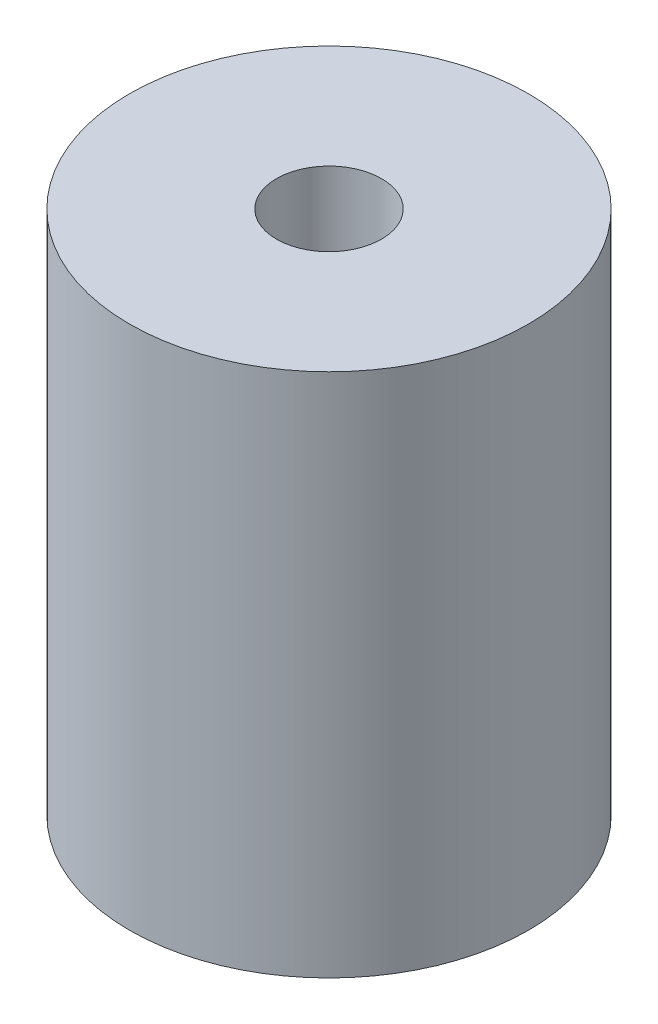
ISO-10303-21;
HEADER;
FILE_DESCRIPTION(('STEP AP214'),'2;1');
FILE_NAME('part.step','',(''),(''),'','','');
FILE_SCHEMA(('AUTOMOTIVE_DESIGN { 1 0 10303 214 1 1 1 1 }'));
ENDSEC;
DATA;
#1=APPLICATION_CONTEXT('core data for automotive mechanical design processes');
#2=APPLICATION_PROTOCOL_DEFINITION('international standard','automotive_design',2000,#1);
#3=PRODUCT_CONTEXT('',#1,'mechanical');
#4=PRODUCT('Part','Part','',(#3));
#5=PRODUCT_RELATED_PRODUCT_CATEGORY('part','',(#4));
#6=PRODUCT_DEFINITION_FORMATION('','',#4);
#7=PRODUCT_DEFINITION_CONTEXT('part definition',#1,'design');
#8=PRODUCT_DEFINITION('design','',#6,#7);
#9=PRODUCT_DEFINITION_SHAPE('','',#8);
#10=(LENGTH_UNIT() NAMED_UNIT(*) SI_UNIT(.MILLI.,.METRE.));
#11=(NAMED_UNIT(*) PLANE_ANGLE_UNIT() SI_UNIT($,.RADIAN.));
#12=(NAMED_UNIT(*) SI_UNIT($,.STERADIAN.) SOLID_ANGLE_UNIT());
#13=UNCERTAINTY_MEASURE_WITH_UNIT(LENGTH_MEASURE(1.E-05),#10,'distance_accuracy_value','');
#14=(GEOMETRIC_REPRESENTATION_CONTEXT(3) GLOBAL_UNCERTAINTY_ASSIGNED_CONTEXT((#13)) GLOBAL_UNIT_ASSIGNED_CONTEXT((#10,
#11,#12)) REPRESENTATION_CONTEXT('',''));
#15=CARTESIAN_POINT('',(0.,0.,0.));
#16=DIRECTION('',(0.,0.,1.));
#17=DIRECTION('',(1.,0.,0.));
#18=AXIS2_PLACEMENT_3D('',#15,#16,#17);
#19=CARTESIAN_POINT('',(0.,25.,0.));
#20=DIRECTION('',(0.,-1.,0.));
#21=DIRECTION('',(0.,0.,-1.));
#22=AXIS2_PLACEMENT_3D('',#19,#20,#21);
#23=CYLINDRICAL_SURFACE('',#22,9.5);
#24=CARTESIAN_POINT('',(0.,25.,0.));
#25=DIRECTION('',(0.,1.,0.));
#26=DIRECTION('',(0.,0.,1.));
#27=AXIS2_PLACEMENT_3D('',#24,#25,#26);
#28=CIRCLE('',#27,9.5);
#29=CARTESIAN_POINT('',(0.,25.,9.5));
#30=VERTEX_POINT('',#29);
#31=EDGE_CURVE('E12',#30,#30,#28,.T.);
#32=ORIENTED_EDGE('',*,*,#31,.F.);
#33=EDGE_LOOP('',(#32));
#34=FACE_BOUND('',#33,.T.);
#35=CARTESIAN_POINT('',(0.,0.,0.));
#36=DIRECTION('',(0.,1.,0.));
#37=DIRECTION('',(0.,0.,1.));
#38=AXIS2_PLACEMENT_3D('',#35,#36,#37);
#39=CIRCLE('',#38,9.5);
#40=CARTESIAN_POINT('',(0.,0.,9.5));
#41=VERTEX_POINT('',#40);
#42=EDGE_CURVE('E52',#41,#41,#39,.T.);
#43=ORIENTED_EDGE('',*,*,#42,.T.);
#44=EDGE_LOOP('',(#43));
#45=FACE_BOUND('',#44,.T.);
#46=ADVANCED_FACE('F45',(#34,#45),#23,.T.);
#47=CARTESIAN_POINT('',(0.,25.,0.));
#48=DIRECTION('',(0.,1.,0.));
#49=DIRECTION('',(0.,0.,1.));
#50=AXIS2_PLACEMENT_3D('',#47,#48,#49);
#51=PLANE('',#50);
#52=CARTESIAN_POINT('',(0.,25.,0.));
#53=DIRECTION('',(0.,1.,0.));
#54=DIRECTION('',(0.,0.,1.));
#55=AXIS2_PLACEMENT_3D('',#52,#53,#54);
#56=CIRCLE('',#55,2.5);
#57=CARTESIAN_POINT('',(0.,25.,2.5));
#58=VERTEX_POINT('',#57);
#59=EDGE_CURVE('E64',#58,#58,#56,.T.);
#60=ORIENTED_EDGE('',*,*,#59,.F.);
#61=EDGE_LOOP('',(#60));
#62=FACE_BOUND('',#61,.T.);
#63=ORIENTED_EDGE('',*,*,#31,.T.);
#64=EDGE_LOOP('',(#63));
#65=FACE_BOUND('',#64,.T.);
#66=ADVANCED_FACE('F88',(#62,#65),#51,.T.);
#67=CARTESIAN_POINT('',(0.,0.,0.));
#68=DIRECTION('',(0.,1.,0.));
#69=DIRECTION('',(0.,0.,1.));
#70=AXIS2_PLACEMENT_3D('',#67,#68,#69);
#71=PLANE('',#70);
#72=CARTESIAN_POINT('',(0.,0.,0.));
#73=DIRECTION('',(0.,-1.,0.));
#74=DIRECTION('',(0.,0.,-1.));
#75=AXIS2_PLACEMENT_3D('',#72,#73,#74);
#76=CIRCLE('',#75,5.);
#77=CARTESIAN_POINT('',(0.,0.,-5.));
#78=VERTEX_POINT('',#77);
#79=EDGE_CURVE('E59',#78,#78,#76,.T.);
#80=ORIENTED_EDGE('',*,*,#79,.F.);
#81=EDGE_LOOP('',(#80));
#82=FACE_BOUND('',#81,.T.);
#83=ORIENTED_EDGE('',*,*,#42,.F.);
#84=EDGE_LOOP('',(#83));
#85=FACE_BOUND('',#84,.T.);
#86=ADVANCED_FACE('F82',(#82,#85),#71,.F.);
#87=CARTESIAN_POINT('',(0.,10.,0.));
#88=DIRECTION('',(0.,-1.,0.));
#89=DIRECTION('',(0.,0.,-1.));
#90=AXIS2_PLACEMENT_3D('',#87,#88,#89);
#91=CYLINDRICAL_SURFACE('',#90,5.);
#92=CARTESIAN_POINT('',(0.,10.,0.));
#93=DIRECTION('',(0.,-1.,0.));
#94=DIRECTION('',(0.,0.,-1.));
#95=AXIS2_PLACEMENT_3D('',#92,#93,#94);
#96=CIRCLE('',#95,5.);
#97=CARTESIAN_POINT('',(0.,10.,-5.));
#98=VERTEX_POINT('',#97);
#99=EDGE_CURVE('E57',#98,#98,#96,.T.);
#100=ORIENTED_EDGE('',*,*,#99,.F.);
#101=EDGE_LOOP('',(#100));
#102=FACE_BOUND('',#101,.T.);
#103=ORIENTED_EDGE('',*,*,#79,.T.);
#104=EDGE_LOOP('',(#103));
#105=FACE_BOUND('',#104,.T.);
#106=ADVANCED_FACE('F76',(#102,#105),#91,.F.);
#107=CARTESIAN_POINT('',(0.,10.,0.));
#108=DIRECTION('',(0.,-1.,0.));
#109=DIRECTION('',(0.,0.,-1.));
#110=AXIS2_PLACEMENT_3D('',#107,#108,#109);
#111=PLANE('',#110);
#112=CARTESIAN_POINT('',(0.,10.,0.));
#113=DIRECTION('',(0.,-1.,0.));
#114=DIRECTION('',(0.,0.,-1.));
#115=AXIS2_PLACEMENT_3D('',#112,#113,#114);
#116=CIRCLE('',#115,2.5);
#117=CARTESIAN_POINT('',(0.,10.,-2.5));
#118=VERTEX_POINT('',#117);
#119=EDGE_CURVE('E48',#118,#118,#116,.T.);
#120=ORIENTED_EDGE('',*,*,#119,.F.);
#121=EDGE_LOOP('',(#120));
#122=FACE_BOUND('',#121,.T.);
#123=ORIENTED_EDGE('',*,*,#99,.T.);
#124=EDGE_LOOP('',(#123));
#125=FACE_BOUND('',#124,.T.);
#126=ADVANCED_FACE('F73',(#122,#125),#111,.T.);
#127=CARTESIAN_POINT('',(0.,0.,0.));
#128=DIRECTION('',(0.,1.,0.));
#129=DIRECTION('',(0.,0.,1.));
#130=AXIS2_PLACEMENT_3D('',#127,#128,#129);
#131=CYLINDRICAL_SURFACE('',#130,2.5);
#132=ORIENTED_EDGE('',*,*,#119,.T.);
#133=EDGE_LOOP('',(#132));
#134=FACE_BOUND('',#133,.T.);
#135=ORIENTED_EDGE('',*,*,#59,.T.);
#136=EDGE_LOOP('',(#135));
#137=FACE_BOUND('',#136,.T.);
#138=ADVANCED_FACE('F71',(#134,#137),#131,.F.);
#139=CLOSED_SHELL('',(#46,#66,#86,#106,#126,#138));
#140=MANIFOLD_SOLID_BREP('B2',#139);
#141=ADVANCED_BREP_SHAPE_REPRESENTATION('',(#18,#140),#14);
#142=SHAPE_DEFINITION_REPRESENTATION(#9,#141);
ENDSEC;
END-ISO-10303-21;
